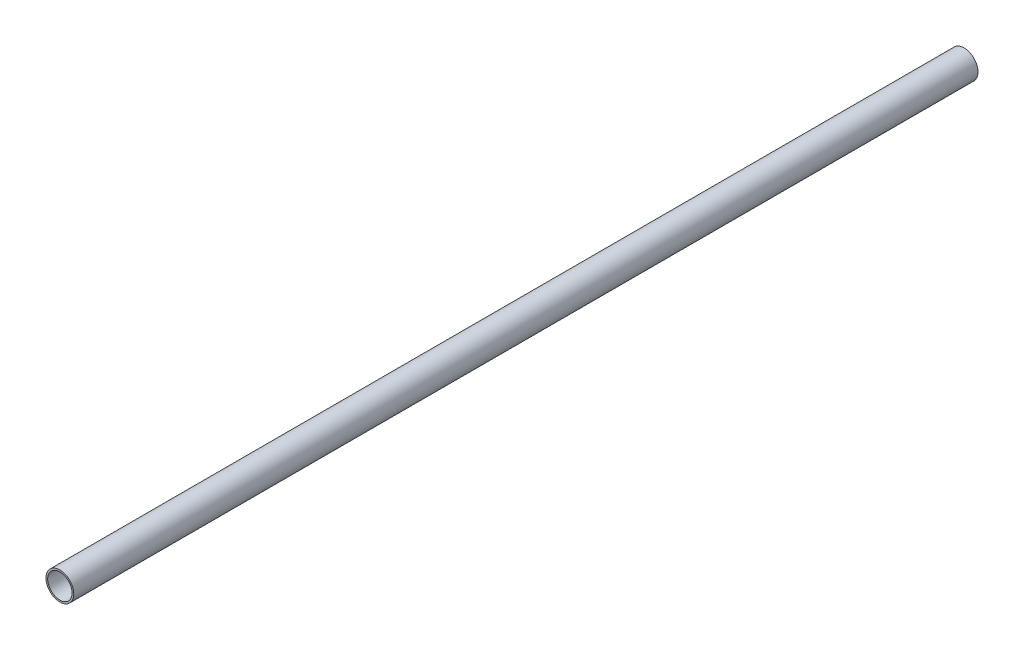
ISO-10303-21;
HEADER;
FILE_DESCRIPTION(('STEP AP214'),'2;1');
FILE_NAME('part.step','',(''),(''),'','','');
FILE_SCHEMA(('AUTOMOTIVE_DESIGN { 1 0 10303 214 1 1 1 1 }'));
ENDSEC;
DATA;
#1=APPLICATION_CONTEXT('core data for automotive mechanical design processes');
#2=APPLICATION_PROTOCOL_DEFINITION('international standard','automotive_design',2000,#1);
#3=PRODUCT_CONTEXT('',#1,'mechanical');
#4=PRODUCT('Part','Part','',(#3));
#5=PRODUCT_RELATED_PRODUCT_CATEGORY('part','',(#4));
#6=PRODUCT_DEFINITION_FORMATION('','',#4);
#7=PRODUCT_DEFINITION_CONTEXT('part definition',#1,'design');
#8=PRODUCT_DEFINITION('design','',#6,#7);
#9=PRODUCT_DEFINITION_SHAPE('','',#8);
#10=(LENGTH_UNIT() NAMED_UNIT(*) SI_UNIT(.MILLI.,.METRE.));
#11=(NAMED_UNIT(*) PLANE_ANGLE_UNIT() SI_UNIT($,.RADIAN.));
#12=(NAMED_UNIT(*) SI_UNIT($,.STERADIAN.) SOLID_ANGLE_UNIT());
#13=UNCERTAINTY_MEASURE_WITH_UNIT(LENGTH_MEASURE(1.E-05),#10,'distance_accuracy_value','');
#14=(GEOMETRIC_REPRESENTATION_CONTEXT(3) GLOBAL_UNCERTAINTY_ASSIGNED_CONTEXT((#13)) GLOBAL_UNIT_ASSIGNED_CONTEXT((#10,
#11,#12)) REPRESENTATION_CONTEXT('',''));
#15=CARTESIAN_POINT('',(0.,0.,0.));
#16=DIRECTION('',(0.,0.,1.));
#17=DIRECTION('',(1.,0.,0.));
#18=AXIS2_PLACEMENT_3D('',#15,#16,#17);
#19=CARTESIAN_POINT('',(0.,0.,470.8));
#20=DIRECTION('',(0.,0.,1.));
#21=DIRECTION('',(1.,0.,0.));
#22=AXIS2_PLACEMENT_3D('',#19,#20,#21);
#23=PLANE('',#22);
#24=CARTESIAN_POINT('',(0.,0.,470.8));
#25=DIRECTION('',(0.,0.,1.));
#26=DIRECTION('',(1.,0.,0.));
#27=AXIS2_PLACEMENT_3D('',#24,#25,#26);
#28=CIRCLE('',#27,7.239);
#29=CARTESIAN_POINT('',(7.239,0.,470.8));
#30=VERTEX_POINT('',#29);
#31=EDGE_CURVE('E10',#30,#30,#28,.T.);
#32=ORIENTED_EDGE('',*,*,#31,.T.);
#33=EDGE_LOOP('',(#32));
#34=FACE_BOUND('',#33,.T.);
#35=CARTESIAN_POINT('',(0.,0.,470.8));
#36=DIRECTION('',(0.,0.,1.));
#37=DIRECTION('',(1.,0.,0.));
#38=AXIS2_PLACEMENT_3D('',#35,#36,#37);
#39=CIRCLE('',#38,6.35);
#40=CARTESIAN_POINT('',(6.35,0.,470.8));
#41=VERTEX_POINT('',#40);
#42=EDGE_CURVE('E43',#41,#41,#39,.T.);
#43=ORIENTED_EDGE('',*,*,#42,.F.);
#44=EDGE_LOOP('',(#43));
#45=FACE_BOUND('',#44,.T.);
#46=ADVANCED_FACE('F32',(#34,#45),#23,.T.);
#47=CARTESIAN_POINT('',(0.,0.,0.));
#48=DIRECTION('',(0.,0.,1.));
#49=DIRECTION('',(1.,0.,0.));
#50=AXIS2_PLACEMENT_3D('',#47,#48,#49);
#51=PLANE('',#50);
#52=CARTESIAN_POINT('',(0.,0.,0.));
#53=DIRECTION('',(0.,0.,1.));
#54=DIRECTION('',(1.,0.,0.));
#55=AXIS2_PLACEMENT_3D('',#52,#53,#54);
#56=CIRCLE('',#55,7.239);
#57=CARTESIAN_POINT('',(7.239,0.,0.));
#58=VERTEX_POINT('',#57);
#59=EDGE_CURVE('E36',#58,#58,#56,.T.);
#60=ORIENTED_EDGE('',*,*,#59,.F.);
#61=EDGE_LOOP('',(#60));
#62=FACE_BOUND('',#61,.T.);
#63=CARTESIAN_POINT('',(0.,0.,0.));
#64=DIRECTION('',(0.,0.,1.));
#65=DIRECTION('',(1.,0.,0.));
#66=AXIS2_PLACEMENT_3D('',#63,#64,#65);
#67=CIRCLE('',#66,6.35);
#68=CARTESIAN_POINT('',(6.35,0.,0.));
#69=VERTEX_POINT('',#68);
#70=EDGE_CURVE('E45',#69,#69,#67,.T.);
#71=ORIENTED_EDGE('',*,*,#70,.T.);
#72=EDGE_LOOP('',(#71));
#73=FACE_BOUND('',#72,.T.);
#74=ADVANCED_FACE('F55',(#62,#73),#51,.F.);
#75=CARTESIAN_POINT('',(0.,0.,470.8));
#76=DIRECTION('',(0.,0.,-1.));
#77=DIRECTION('',(-1.,0.,0.));
#78=AXIS2_PLACEMENT_3D('',#75,#76,#77);
#79=CYLINDRICAL_SURFACE('',#78,7.239);
#80=ORIENTED_EDGE('',*,*,#31,.F.);
#81=EDGE_LOOP('',(#80));
#82=FACE_BOUND('',#81,.T.);
#83=ORIENTED_EDGE('',*,*,#59,.T.);
#84=EDGE_LOOP('',(#83));
#85=FACE_BOUND('',#84,.T.);
#86=ADVANCED_FACE('F34',(#82,#85),#79,.T.);
#87=CARTESIAN_POINT('',(0.,0.,470.8));
#88=DIRECTION('',(0.,0.,-1.));
#89=DIRECTION('',(-1.,0.,0.));
#90=AXIS2_PLACEMENT_3D('',#87,#88,#89);
#91=CYLINDRICAL_SURFACE('',#90,6.35);
#92=ORIENTED_EDGE('',*,*,#42,.T.);
#93=EDGE_LOOP('',(#92));
#94=FACE_BOUND('',#93,.T.);
#95=ORIENTED_EDGE('',*,*,#70,.F.);
#96=EDGE_LOOP('',(#95));
#97=FACE_BOUND('',#96,.T.);
#98=ADVANCED_FACE('F51',(#94,#97),#91,.F.);
#99=CLOSED_SHELL('',(#46,#74,#86,#98));
#100=MANIFOLD_SOLID_BREP('B2',#99);
#101=ADVANCED_BREP_SHAPE_REPRESENTATION('',(#18,#100),#14);
#102=SHAPE_DEFINITION_REPRESENTATION(#9,#101);
ENDSEC;
END-ISO-10303-21;
